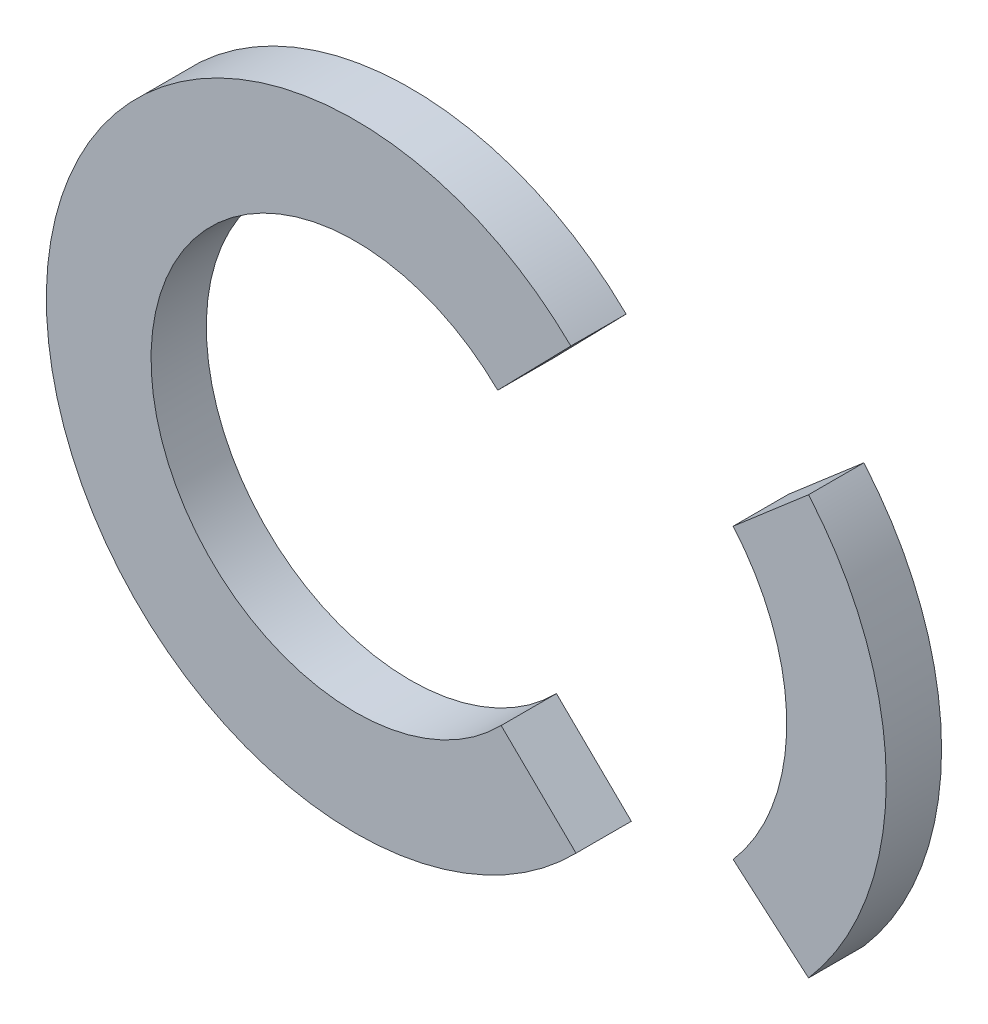
ISO-10303-21;
HEADER;
FILE_DESCRIPTION(('STEP AP214'),'2;1');
FILE_NAME('part.step','',(''),(''),'','','');
FILE_SCHEMA(('AUTOMOTIVE_DESIGN { 1 0 10303 214 1 1 1 1 }'));
ENDSEC;
DATA;
#1=APPLICATION_CONTEXT('core data for automotive mechanical design processes');
#2=APPLICATION_PROTOCOL_DEFINITION('international standard','automotive_design',2000,#1);
#3=PRODUCT_CONTEXT('',#1,'mechanical');
#4=PRODUCT('Part','Part','',(#3));
#5=PRODUCT_RELATED_PRODUCT_CATEGORY('part','',(#4));
#6=PRODUCT_DEFINITION_FORMATION('','',#4);
#7=PRODUCT_DEFINITION_CONTEXT('part definition',#1,'design');
#8=PRODUCT_DEFINITION('design','',#6,#7);
#9=PRODUCT_DEFINITION_SHAPE('','',#8);
#10=(LENGTH_UNIT() NAMED_UNIT(*) SI_UNIT(.MILLI.,.METRE.));
#11=(NAMED_UNIT(*) PLANE_ANGLE_UNIT() SI_UNIT($,.RADIAN.));
#12=(NAMED_UNIT(*) SI_UNIT($,.STERADIAN.) SOLID_ANGLE_UNIT());
#13=UNCERTAINTY_MEASURE_WITH_UNIT(LENGTH_MEASURE(1.E-05),#10,'distance_accuracy_value','');
#14=(GEOMETRIC_REPRESENTATION_CONTEXT(3) GLOBAL_UNCERTAINTY_ASSIGNED_CONTEXT((#13)) GLOBAL_UNIT_ASSIGNED_CONTEXT((#10,
#11,#12)) REPRESENTATION_CONTEXT('',''));
#15=CARTESIAN_POINT('',(0.,0.,0.));
#16=DIRECTION('',(0.,0.,1.));
#17=DIRECTION('',(1.,0.,0.));
#18=AXIS2_PLACEMENT_3D('',#15,#16,#17);
#19=CARTESIAN_POINT('',(38.0804977741769,0.310067878557427,10.));
#20=DIRECTION('',(0.,0.,-1.));
#21=DIRECTION('',(-1.,0.,0.));
#22=AXIS2_PLACEMENT_3D('',#19,#20,#21);
#23=CYLINDRICAL_SURFACE('',#22,39.9838147077172);
#24=CARTESIAN_POINT('',(38.0804977741769,0.310067878557427,0.));
#25=DIRECTION('',(0.,0.,-1.));
#26=DIRECTION('',(-1.,0.,0.));
#27=AXIS2_PLACEMENT_3D('',#24,#25,#26);
#28=CIRCLE('',#27,39.9838147077172);
#29=CARTESIAN_POINT('',(68.3715319271683,26.4090848815669,0.));
#30=VERTEX_POINT('',#29);
#31=CARTESIAN_POINT('',(68.3715319271683,-25.788949124452,0.));
#32=VERTEX_POINT('',#31);
#33=EDGE_CURVE('E106',#30,#32,#28,.T.);
#34=ORIENTED_EDGE('',*,*,#33,.T.);
#35=DIRECTION('',(0.,0.,-1.));
#36=VECTOR('',#35,1.);
#37=CARTESIAN_POINT('',(68.3715319271683,-25.788949124452,10.));
#38=LINE('',#37,#36);
#39=CARTESIAN_POINT('',(68.3715319271683,-25.788949124452,10.));
#40=VERTEX_POINT('',#39);
#41=EDGE_CURVE('E12',#40,#32,#38,.T.);
#42=ORIENTED_EDGE('',*,*,#41,.F.);
#43=CARTESIAN_POINT('',(38.0804977741769,0.310067878557427,10.));
#44=DIRECTION('',(0.,0.,-1.));
#45=DIRECTION('',(-1.,0.,0.));
#46=AXIS2_PLACEMENT_3D('',#43,#44,#45);
#47=CIRCLE('',#46,39.9838147077172);
#48=CARTESIAN_POINT('',(68.3715319271683,26.4090848815669,10.));
#49=VERTEX_POINT('',#48);
#50=EDGE_CURVE('E94',#49,#40,#47,.T.);
#51=ORIENTED_EDGE('',*,*,#50,.F.);
#52=DIRECTION('',(0.,0.,-1.));
#53=VECTOR('',#52,1.);
#54=CARTESIAN_POINT('',(68.3715319271683,26.4090848815669,10.));
#55=LINE('',#54,#53);
#56=EDGE_CURVE('E102',#49,#30,#55,.T.);
#57=ORIENTED_EDGE('',*,*,#56,.T.);
#58=EDGE_LOOP('',(#34,#42,#51,#57));
#59=FACE_BOUND('',#58,.T.);
#60=ADVANCED_FACE('F43',(#59),#23,.F.);
#61=CARTESIAN_POINT('',(68.3715319271683,-25.788949124452,10.));
#62=DIRECTION('',(0.652739544583078,0.757582396137526,0.));
#63=DIRECTION('',(-0.757582396137526,0.652739544583078,0.));
#64=AXIS2_PLACEMENT_3D('',#61,#62,#63);
#65=PLANE('',#64);
#66=DIRECTION('',(0.757582396137526,-0.652739544583078,0.));
#67=VECTOR('',#66,1.);
#68=CARTESIAN_POINT('',(68.3715319271683,-25.788949124452,0.));
#69=LINE('',#68,#67);
#70=CARTESIAN_POINT('',(82.0080150576437,-37.5382609269475,0.));
#71=VERTEX_POINT('',#70);
#72=EDGE_CURVE('E98',#32,#71,#69,.T.);
#73=ORIENTED_EDGE('',*,*,#72,.T.);
#74=DIRECTION('',(0.,0.,-1.));
#75=VECTOR('',#74,1.);
#76=CARTESIAN_POINT('',(82.0080150576437,-37.5382609269475,10.));
#77=LINE('',#76,#75);
#78=CARTESIAN_POINT('',(82.0080150576437,-37.5382609269475,10.));
#79=VERTEX_POINT('',#78);
#80=EDGE_CURVE('E51',#79,#71,#77,.T.);
#81=ORIENTED_EDGE('',*,*,#80,.F.);
#82=DIRECTION('',(0.757582396137526,-0.652739544583078,0.));
#83=VECTOR('',#82,1.);
#84=CARTESIAN_POINT('',(68.3715319271683,-25.788949124452,10.));
#85=LINE('',#84,#83);
#86=EDGE_CURVE('E89',#40,#79,#85,.T.);
#87=ORIENTED_EDGE('',*,*,#86,.F.);
#88=ORIENTED_EDGE('',*,*,#41,.T.);
#89=EDGE_LOOP('',(#73,#81,#87,#88));
#90=FACE_BOUND('',#89,.T.);
#91=ADVANCED_FACE('F97',(#90),#65,.F.);
#92=CARTESIAN_POINT('',(38.0804977741769,0.310067878557427,10.));
#93=DIRECTION('',(0.,0.,-1.));
#94=DIRECTION('',(-1.,0.,0.));
#95=AXIS2_PLACEMENT_3D('',#92,#93,#94);
#96=CYLINDRICAL_SURFACE('',#95,57.9838147077172);
#97=CARTESIAN_POINT('',(38.0804977741769,0.310067878557427,0.));
#98=DIRECTION('',(0.,0.,1.));
#99=DIRECTION('',(-1.,0.,0.));
#100=AXIS2_PLACEMENT_3D('',#97,#98,#99);
#101=CIRCLE('',#100,57.9838147077172);
#102=CARTESIAN_POINT('',(82.0080150576438,38.1583966840623,0.));
#103=VERTEX_POINT('',#102);
#104=EDGE_CURVE('E76',#71,#103,#101,.T.);
#105=ORIENTED_EDGE('',*,*,#104,.T.);
#106=DIRECTION('',(0.,0.,-1.));
#107=VECTOR('',#106,1.);
#108=CARTESIAN_POINT('',(82.0080150576438,38.1583966840623,10.));
#109=LINE('',#108,#107);
#110=CARTESIAN_POINT('',(82.0080150576438,38.1583966840623,10.));
#111=VERTEX_POINT('',#110);
#112=EDGE_CURVE('E99',#111,#103,#109,.T.);
#113=ORIENTED_EDGE('',*,*,#112,.F.);
#114=CARTESIAN_POINT('',(38.0804977741769,0.310067878557427,10.));
#115=DIRECTION('',(0.,0.,1.));
#116=DIRECTION('',(-1.,0.,0.));
#117=AXIS2_PLACEMENT_3D('',#114,#115,#116);
#118=CIRCLE('',#117,57.9838147077172);
#119=EDGE_CURVE('E92',#79,#111,#118,.T.);
#120=ORIENTED_EDGE('',*,*,#119,.F.);
#121=ORIENTED_EDGE('',*,*,#80,.T.);
#122=EDGE_LOOP('',(#105,#113,#120,#121));
#123=FACE_BOUND('',#122,.T.);
#124=ADVANCED_FACE('F100',(#123),#96,.T.);
#125=CARTESIAN_POINT('',(82.0080150576438,38.1583966840623,10.));
#126=DIRECTION('',(0.652739544583077,-0.757582396137527,0.));
#127=DIRECTION('',(0.757582396137527,0.652739544583077,0.));
#128=AXIS2_PLACEMENT_3D('',#125,#126,#127);
#129=PLANE('',#128);
#130=DIRECTION('',(-0.757582396137527,-0.652739544583077,0.));
#131=VECTOR('',#130,1.);
#132=CARTESIAN_POINT('',(82.0080150576438,38.1583966840623,0.));
#133=LINE('',#132,#131);
#134=EDGE_CURVE('E82',#103,#30,#133,.T.);
#135=ORIENTED_EDGE('',*,*,#134,.T.);
#136=ORIENTED_EDGE('',*,*,#56,.F.);
#137=DIRECTION('',(-0.757582396137527,-0.652739544583077,0.));
#138=VECTOR('',#137,1.);
#139=CARTESIAN_POINT('',(82.0080150576438,38.1583966840623,10.));
#140=LINE('',#139,#138);
#141=EDGE_CURVE('E59',#111,#49,#140,.T.);
#142=ORIENTED_EDGE('',*,*,#141,.F.);
#143=ORIENTED_EDGE('',*,*,#112,.T.);
#144=EDGE_LOOP('',(#135,#136,#142,#143));
#145=FACE_BOUND('',#144,.T.);
#146=ADVANCED_FACE('F113',(#145),#129,.F.);
#147=CARTESIAN_POINT('',(38.0804977741769,0.310067878557427,10.));
#148=DIRECTION('',(0.,0.,-1.));
#149=DIRECTION('',(-1.,0.,0.));
#150=AXIS2_PLACEMENT_3D('',#147,#148,#149);
#151=PLANE('',#150);
#152=ORIENTED_EDGE('',*,*,#50,.T.);
#153=ORIENTED_EDGE('',*,*,#86,.T.);
#154=ORIENTED_EDGE('',*,*,#119,.T.);
#155=ORIENTED_EDGE('',*,*,#141,.T.);
#156=EDGE_LOOP('',(#152,#153,#154,#155));
#157=FACE_BOUND('',#156,.T.);
#158=ADVANCED_FACE('F90',(#157),#151,.F.);
#159=CARTESIAN_POINT('',(38.0804977741769,0.310067878557427,0.));
#160=DIRECTION('',(0.,0.,-1.));
#161=DIRECTION('',(-1.,0.,0.));
#162=AXIS2_PLACEMENT_3D('',#159,#160,#161);
#163=PLANE('',#162);
#164=ORIENTED_EDGE('',*,*,#33,.F.);
#165=ORIENTED_EDGE('',*,*,#134,.F.);
#166=ORIENTED_EDGE('',*,*,#104,.F.);
#167=ORIENTED_EDGE('',*,*,#72,.F.);
#168=EDGE_LOOP('',(#164,#165,#166,#167));
#169=FACE_BOUND('',#168,.T.);
#170=ADVANCED_FACE('F116',(#169),#163,.T.);
#171=CLOSED_SHELL('',(#60,#91,#124,#146,#158,#170));
#172=MANIFOLD_SOLID_BREP('B2',#171);
#173=CARTESIAN_POINT('',(0.,0.,10.));
#174=DIRECTION('',(0.,0.,-1.));
#175=DIRECTION('',(-1.,0.,0.));
#176=AXIS2_PLACEMENT_3D('',#173,#174,#175);
#177=CYLINDRICAL_SURFACE('',#176,36.9121885185013);
#178=CARTESIAN_POINT('',(0.,0.,0.));
#179=DIRECTION('',(0.,0.,-1.));
#180=DIRECTION('',(1.,0.,0.));
#181=AXIS2_PLACEMENT_3D('',#178,#179,#180);
#182=CIRCLE('',#181,36.9121885185013);
#183=CARTESIAN_POINT('',(26.4090848815669,-25.788949124452,0.));
#184=VERTEX_POINT('',#183);
#185=CARTESIAN_POINT('',(25.788949124452,26.4090848815669,0.));
#186=VERTEX_POINT('',#185);
#187=EDGE_CURVE('E230',#184,#186,#182,.T.);
#188=ORIENTED_EDGE('',*,*,#187,.T.);
#189=DIRECTION('',(0.,0.,-1.));
#190=VECTOR('',#189,1.);
#191=CARTESIAN_POINT('',(25.788949124452,26.4090848815669,10.));
#192=LINE('',#191,#190);
#193=CARTESIAN_POINT('',(25.788949124452,26.4090848815669,10.));
#194=VERTEX_POINT('',#193);
#195=EDGE_CURVE('E41',#194,#186,#192,.T.);
#196=ORIENTED_EDGE('',*,*,#195,.F.);
#197=CARTESIAN_POINT('',(0.,0.,10.));
#198=DIRECTION('',(0.,0.,-1.));
#199=DIRECTION('',(1.,0.,0.));
#200=AXIS2_PLACEMENT_3D('',#197,#198,#199);
#201=CIRCLE('',#200,36.9121885185013);
#202=CARTESIAN_POINT('',(26.4090848815669,-25.788949124452,10.));
#203=VERTEX_POINT('',#202);
#204=EDGE_CURVE('E218',#203,#194,#201,.T.);
#205=ORIENTED_EDGE('',*,*,#204,.F.);
#206=DIRECTION('',(0.,0.,-1.));
#207=VECTOR('',#206,1.);
#208=CARTESIAN_POINT('',(26.4090848815669,-25.788949124452,10.));
#209=LINE('',#208,#207);
#210=EDGE_CURVE('E226',#203,#184,#209,.T.);
#211=ORIENTED_EDGE('',*,*,#210,.T.);
#212=EDGE_LOOP('',(#188,#196,#205,#211));
#213=FACE_BOUND('',#212,.T.);
#214=ADVANCED_FACE('F167',(#213),#177,.F.);
#215=CARTESIAN_POINT('',(39.0161536204809,39.9543582696267,10.));
#216=DIRECTION('',(-0.715457033069985,0.698656735336242,0.));
#217=DIRECTION('',(-0.698656735336242,-0.715457033069985,0.));
#218=AXIS2_PLACEMENT_3D('',#215,#216,#217);
#219=PLANE('',#218);
#220=DIRECTION('',(0.698656735336242,0.715457033069984,0.));
#221=VECTOR('',#220,1.);
#222=CARTESIAN_POINT('',(39.0161536204809,39.9543582696267,0.));
#223=LINE('',#222,#221);
#224=CARTESIAN_POINT('',(39.0161536204809,39.9543582696267,0.));
#225=VERTEX_POINT('',#224);
#226=EDGE_CURVE('E222',#186,#225,#223,.T.);
#227=ORIENTED_EDGE('',*,*,#226,.T.);
#228=DIRECTION('',(0.,0.,-1.));
#229=VECTOR('',#228,1.);
#230=CARTESIAN_POINT('',(39.0161536204809,39.9543582696267,10.));
#231=LINE('',#230,#229);
#232=CARTESIAN_POINT('',(39.0161536204809,39.9543582696267,10.));
#233=VERTEX_POINT('',#232);
#234=EDGE_CURVE('E175',#233,#225,#231,.T.);
#235=ORIENTED_EDGE('',*,*,#234,.F.);
#236=DIRECTION('',(0.698656735336242,0.715457033069984,0.));
#237=VECTOR('',#236,1.);
#238=CARTESIAN_POINT('',(39.0161536204809,39.9543582696267,10.));
#239=LINE('',#238,#237);
#240=EDGE_CURVE('E213',#194,#233,#239,.T.);
#241=ORIENTED_EDGE('',*,*,#240,.F.);
#242=ORIENTED_EDGE('',*,*,#195,.T.);
#243=EDGE_LOOP('',(#227,#235,#241,#242));
#244=FACE_BOUND('',#243,.T.);
#245=ADVANCED_FACE('F221',(#244),#219,.F.);
#246=CARTESIAN_POINT('',(0.,0.,10.));
#247=DIRECTION('',(0.,0.,-1.));
#248=DIRECTION('',(-1.,0.,0.));
#249=AXIS2_PLACEMENT_3D('',#246,#247,#248);
#250=CYLINDRICAL_SURFACE('',#249,55.8445251396648);
#251=CARTESIAN_POINT('',(0.,0.,0.));
#252=DIRECTION('',(0.,0.,1.));
#253=DIRECTION('',(1.,0.,0.));
#254=AXIS2_PLACEMENT_3D('',#251,#252,#253);
#255=CIRCLE('',#254,55.8445251396648);
#256=CARTESIAN_POINT('',(39.9543582696267,-39.0161536204809,0.));
#257=VERTEX_POINT('',#256);
#258=EDGE_CURVE('E200',#225,#257,#255,.T.);
#259=ORIENTED_EDGE('',*,*,#258,.T.);
#260=DIRECTION('',(0.,0.,-1.));
#261=VECTOR('',#260,1.);
#262=CARTESIAN_POINT('',(39.9543582696267,-39.0161536204809,10.));
#263=LINE('',#262,#261);
#264=CARTESIAN_POINT('',(39.9543582696267,-39.0161536204809,10.));
#265=VERTEX_POINT('',#264);
#266=EDGE_CURVE('E223',#265,#257,#263,.T.);
#267=ORIENTED_EDGE('',*,*,#266,.F.);
#268=CARTESIAN_POINT('',(0.,0.,10.));
#269=DIRECTION('',(0.,0.,1.));
#270=DIRECTION('',(1.,0.,0.));
#271=AXIS2_PLACEMENT_3D('',#268,#269,#270);
#272=CIRCLE('',#271,55.8445251396648);
#273=EDGE_CURVE('E216',#233,#265,#272,.T.);
#274=ORIENTED_EDGE('',*,*,#273,.F.);
#275=ORIENTED_EDGE('',*,*,#234,.T.);
#276=EDGE_LOOP('',(#259,#267,#274,#275));
#277=FACE_BOUND('',#276,.T.);
#278=ADVANCED_FACE('F224',(#277),#250,.T.);
#279=CARTESIAN_POINT('',(26.4090848815669,-25.788949124452,10.));
#280=DIRECTION('',(-0.698656735336242,-0.715457033069984,0.));
#281=DIRECTION('',(0.715457033069984,-0.698656735336242,0.));
#282=AXIS2_PLACEMENT_3D('',#279,#280,#281);
#283=PLANE('',#282);
#284=DIRECTION('',(-0.715457033069984,0.698656735336242,0.));
#285=VECTOR('',#284,1.);
#286=CARTESIAN_POINT('',(26.4090848815669,-25.788949124452,0.));
#287=LINE('',#286,#285);
#288=EDGE_CURVE('E206',#257,#184,#287,.T.);
#289=ORIENTED_EDGE('',*,*,#288,.T.);
#290=ORIENTED_EDGE('',*,*,#210,.F.);
#291=DIRECTION('',(-0.715457033069984,0.698656735336242,0.));
#292=VECTOR('',#291,1.);
#293=CARTESIAN_POINT('',(26.4090848815669,-25.788949124452,10.));
#294=LINE('',#293,#292);
#295=EDGE_CURVE('E183',#265,#203,#294,.T.);
#296=ORIENTED_EDGE('',*,*,#295,.F.);
#297=ORIENTED_EDGE('',*,*,#266,.T.);
#298=EDGE_LOOP('',(#289,#290,#296,#297));
#299=FACE_BOUND('',#298,.T.);
#300=ADVANCED_FACE('F237',(#299),#283,.F.);
#301=CARTESIAN_POINT('',(0.,0.,10.));
#302=DIRECTION('',(0.,0.,1.));
#303=DIRECTION('',(1.,0.,0.));
#304=AXIS2_PLACEMENT_3D('',#301,#302,#303);
#305=PLANE('',#304);
#306=ORIENTED_EDGE('',*,*,#204,.T.);
#307=ORIENTED_EDGE('',*,*,#240,.T.);
#308=ORIENTED_EDGE('',*,*,#273,.T.);
#309=ORIENTED_EDGE('',*,*,#295,.T.);
#310=EDGE_LOOP('',(#306,#307,#308,#309));
#311=FACE_BOUND('',#310,.T.);
#312=ADVANCED_FACE('F214',(#311),#305,.T.);
#313=CARTESIAN_POINT('',(0.,0.,0.));
#314=DIRECTION('',(0.,0.,1.));
#315=DIRECTION('',(1.,0.,0.));
#316=AXIS2_PLACEMENT_3D('',#313,#314,#315);
#317=PLANE('',#316);
#318=ORIENTED_EDGE('',*,*,#187,.F.);
#319=ORIENTED_EDGE('',*,*,#288,.F.);
#320=ORIENTED_EDGE('',*,*,#258,.F.);
#321=ORIENTED_EDGE('',*,*,#226,.F.);
#322=EDGE_LOOP('',(#318,#319,#320,#321));
#323=FACE_BOUND('',#322,.T.);
#324=ADVANCED_FACE('F240',(#323),#317,.F.);
#325=CLOSED_SHELL('',(#214,#245,#278,#300,#312,#324));
#326=MANIFOLD_SOLID_BREP('B6',#325);
#327=ADVANCED_BREP_SHAPE_REPRESENTATION('',(#18,#172,#326),#14);
#328=SHAPE_DEFINITION_REPRESENTATION(#9,#327);
ENDSEC;
END-ISO-10303-21;
